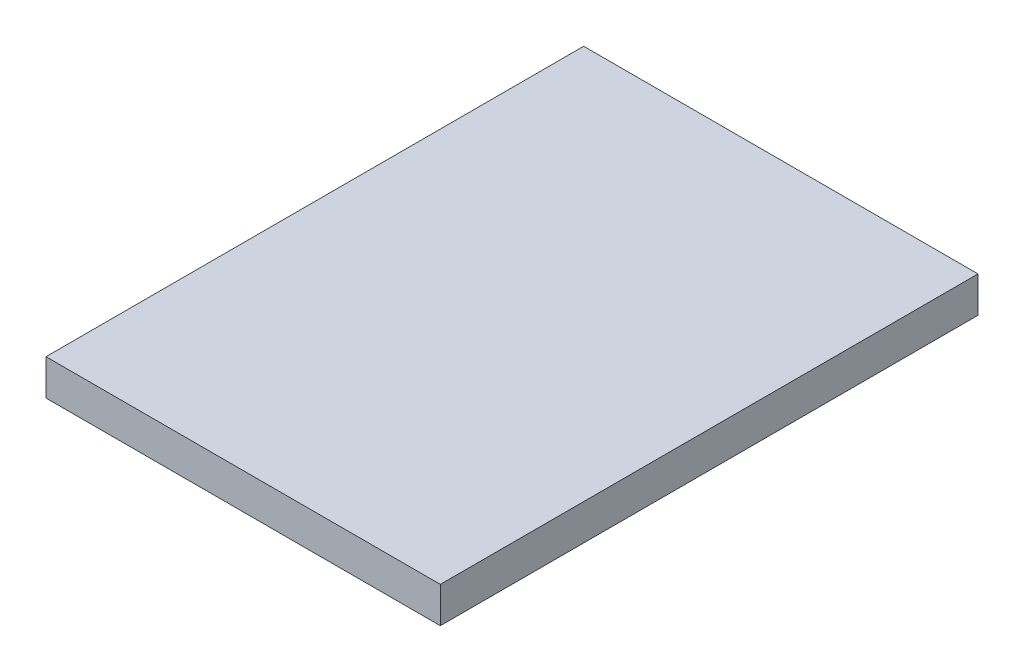
ISO-10303-21;
HEADER;
FILE_DESCRIPTION(('STEP AP214'),'2;1');
FILE_NAME('part.step','',(''),(''),'','','');
FILE_SCHEMA(('AUTOMOTIVE_DESIGN { 1 0 10303 214 1 1 1 1 }'));
ENDSEC;
DATA;
#1=APPLICATION_CONTEXT('core data for automotive mechanical design processes');
#2=APPLICATION_PROTOCOL_DEFINITION('international standard','automotive_design',2000,#1);
#3=PRODUCT_CONTEXT('',#1,'mechanical');
#4=PRODUCT('Part','Part','',(#3));
#5=PRODUCT_RELATED_PRODUCT_CATEGORY('part','',(#4));
#6=PRODUCT_DEFINITION_FORMATION('','',#4);
#7=PRODUCT_DEFINITION_CONTEXT('part definition',#1,'design');
#8=PRODUCT_DEFINITION('design','',#6,#7);
#9=PRODUCT_DEFINITION_SHAPE('','',#8);
#10=(LENGTH_UNIT() NAMED_UNIT(*) SI_UNIT(.MILLI.,.METRE.));
#11=(NAMED_UNIT(*) PLANE_ANGLE_UNIT() SI_UNIT($,.RADIAN.));
#12=(NAMED_UNIT(*) SI_UNIT($,.STERADIAN.) SOLID_ANGLE_UNIT());
#13=UNCERTAINTY_MEASURE_WITH_UNIT(LENGTH_MEASURE(1.E-05),#10,'distance_accuracy_value','');
#14=(GEOMETRIC_REPRESENTATION_CONTEXT(3) GLOBAL_UNCERTAINTY_ASSIGNED_CONTEXT((#13)) GLOBAL_UNIT_ASSIGNED_CONTEXT((#10,
#11,#12)) REPRESENTATION_CONTEXT('',''));
#15=CARTESIAN_POINT('',(0.,0.,0.));
#16=DIRECTION('',(0.,0.,1.));
#17=DIRECTION('',(1.,0.,0.));
#18=AXIS2_PLACEMENT_3D('',#15,#16,#17);
#19=CARTESIAN_POINT('',(-110.,20.,150.));
#20=DIRECTION('',(1.,0.,0.));
#21=DIRECTION('',(0.,0.,-1.));
#22=AXIS2_PLACEMENT_3D('',#19,#20,#21);
#23=PLANE('',#22);
#24=DIRECTION('',(0.,0.,1.));
#25=VECTOR('',#24,1.);
#26=CARTESIAN_POINT('',(-110.,0.,150.));
#27=LINE('',#26,#25);
#28=CARTESIAN_POINT('',(-110.,0.,-150.));
#29=VERTEX_POINT('',#28);
#30=CARTESIAN_POINT('',(-110.,0.,150.));
#31=VERTEX_POINT('',#30);
#32=EDGE_CURVE('E96',#29,#31,#27,.T.);
#33=ORIENTED_EDGE('',*,*,#32,.T.);
#34=DIRECTION('',(0.,-1.,0.));
#35=VECTOR('',#34,1.);
#36=CARTESIAN_POINT('',(-110.,20.,150.));
#37=LINE('',#36,#35);
#38=CARTESIAN_POINT('',(-110.,20.,150.));
#39=VERTEX_POINT('',#38);
#40=EDGE_CURVE('E11',#39,#31,#37,.T.);
#41=ORIENTED_EDGE('',*,*,#40,.F.);
#42=DIRECTION('',(0.,0.,1.));
#43=VECTOR('',#42,1.);
#44=CARTESIAN_POINT('',(-110.,20.,150.));
#45=LINE('',#44,#43);
#46=CARTESIAN_POINT('',(-110.,20.,-150.));
#47=VERTEX_POINT('',#46);
#48=EDGE_CURVE('E84',#47,#39,#45,.T.);
#49=ORIENTED_EDGE('',*,*,#48,.F.);
#50=DIRECTION('',(0.,-1.,0.));
#51=VECTOR('',#50,1.);
#52=CARTESIAN_POINT('',(-110.,20.,-150.));
#53=LINE('',#52,#51);
#54=EDGE_CURVE('E92',#47,#29,#53,.T.);
#55=ORIENTED_EDGE('',*,*,#54,.T.);
#56=EDGE_LOOP('',(#33,#41,#49,#55));
#57=FACE_BOUND('',#56,.T.);
#58=ADVANCED_FACE('F33',(#57),#23,.F.);
#59=CARTESIAN_POINT('',(110.,20.,150.));
#60=DIRECTION('',(0.,0.,-1.));
#61=DIRECTION('',(-1.,0.,0.));
#62=AXIS2_PLACEMENT_3D('',#59,#60,#61);
#63=PLANE('',#62);
#64=DIRECTION('',(1.,0.,0.));
#65=VECTOR('',#64,1.);
#66=CARTESIAN_POINT('',(110.,0.,150.));
#67=LINE('',#66,#65);
#68=CARTESIAN_POINT('',(110.,0.,150.));
#69=VERTEX_POINT('',#68);
#70=EDGE_CURVE('E88',#31,#69,#67,.T.);
#71=ORIENTED_EDGE('',*,*,#70,.T.);
#72=DIRECTION('',(0.,-1.,0.));
#73=VECTOR('',#72,1.);
#74=CARTESIAN_POINT('',(110.,20.,150.));
#75=LINE('',#74,#73);
#76=CARTESIAN_POINT('',(110.,20.,150.));
#77=VERTEX_POINT('',#76);
#78=EDGE_CURVE('E41',#77,#69,#75,.T.);
#79=ORIENTED_EDGE('',*,*,#78,.F.);
#80=DIRECTION('',(1.,0.,0.));
#81=VECTOR('',#80,1.);
#82=CARTESIAN_POINT('',(110.,20.,150.));
#83=LINE('',#82,#81);
#84=EDGE_CURVE('E79',#39,#77,#83,.T.);
#85=ORIENTED_EDGE('',*,*,#84,.F.);
#86=ORIENTED_EDGE('',*,*,#40,.T.);
#87=EDGE_LOOP('',(#71,#79,#85,#86));
#88=FACE_BOUND('',#87,.T.);
#89=ADVANCED_FACE('F87',(#88),#63,.F.);
#90=CARTESIAN_POINT('',(110.,20.,150.));
#91=DIRECTION('',(-1.,0.,0.));
#92=DIRECTION('',(0.,0.,1.));
#93=AXIS2_PLACEMENT_3D('',#90,#91,#92);
#94=PLANE('',#93);
#95=DIRECTION('',(0.,0.,-1.));
#96=VECTOR('',#95,1.);
#97=CARTESIAN_POINT('',(110.,0.,150.));
#98=LINE('',#97,#96);
#99=CARTESIAN_POINT('',(110.,0.,-150.));
#100=VERTEX_POINT('',#99);
#101=EDGE_CURVE('E66',#69,#100,#98,.T.);
#102=ORIENTED_EDGE('',*,*,#101,.T.);
#103=DIRECTION('',(0.,-1.,0.));
#104=VECTOR('',#103,1.);
#105=CARTESIAN_POINT('',(110.,20.,-150.));
#106=LINE('',#105,#104);
#107=CARTESIAN_POINT('',(110.,20.,-150.));
#108=VERTEX_POINT('',#107);
#109=EDGE_CURVE('E89',#108,#100,#106,.T.);
#110=ORIENTED_EDGE('',*,*,#109,.F.);
#111=DIRECTION('',(0.,0.,-1.));
#112=VECTOR('',#111,1.);
#113=CARTESIAN_POINT('',(110.,20.,150.));
#114=LINE('',#113,#112);
#115=EDGE_CURVE('E82',#77,#108,#114,.T.);
#116=ORIENTED_EDGE('',*,*,#115,.F.);
#117=ORIENTED_EDGE('',*,*,#78,.T.);
#118=EDGE_LOOP('',(#102,#110,#116,#117));
#119=FACE_BOUND('',#118,.T.);
#120=ADVANCED_FACE('F90',(#119),#94,.F.);
#121=CARTESIAN_POINT('',(110.,20.,-150.));
#122=DIRECTION('',(0.,0.,1.));
#123=DIRECTION('',(1.,0.,0.));
#124=AXIS2_PLACEMENT_3D('',#121,#122,#123);
#125=PLANE('',#124);
#126=DIRECTION('',(-1.,0.,0.));
#127=VECTOR('',#126,1.);
#128=CARTESIAN_POINT('',(110.,0.,-150.));
#129=LINE('',#128,#127);
#130=EDGE_CURVE('E72',#100,#29,#129,.T.);
#131=ORIENTED_EDGE('',*,*,#130,.T.);
#132=ORIENTED_EDGE('',*,*,#54,.F.);
#133=DIRECTION('',(-1.,0.,0.));
#134=VECTOR('',#133,1.);
#135=CARTESIAN_POINT('',(110.,20.,-150.));
#136=LINE('',#135,#134);
#137=EDGE_CURVE('E49',#108,#47,#136,.T.);
#138=ORIENTED_EDGE('',*,*,#137,.F.);
#139=ORIENTED_EDGE('',*,*,#109,.T.);
#140=EDGE_LOOP('',(#131,#132,#138,#139));
#141=FACE_BOUND('',#140,.T.);
#142=ADVANCED_FACE('F103',(#141),#125,.F.);
#143=CARTESIAN_POINT('',(0.,20.,0.));
#144=DIRECTION('',(0.,1.,0.));
#145=DIRECTION('',(0.,0.,1.));
#146=AXIS2_PLACEMENT_3D('',#143,#144,#145);
#147=PLANE('',#146);
#148=ORIENTED_EDGE('',*,*,#48,.T.);
#149=ORIENTED_EDGE('',*,*,#84,.T.);
#150=ORIENTED_EDGE('',*,*,#115,.T.);
#151=ORIENTED_EDGE('',*,*,#137,.T.);
#152=EDGE_LOOP('',(#148,#149,#150,#151));
#153=FACE_BOUND('',#152,.T.);
#154=ADVANCED_FACE('F80',(#153),#147,.T.);
#155=CARTESIAN_POINT('',(0.,0.,0.));
#156=DIRECTION('',(0.,1.,0.));
#157=DIRECTION('',(0.,0.,1.));
#158=AXIS2_PLACEMENT_3D('',#155,#156,#157);
#159=PLANE('',#158);
#160=ORIENTED_EDGE('',*,*,#32,.F.);
#161=ORIENTED_EDGE('',*,*,#130,.F.);
#162=ORIENTED_EDGE('',*,*,#101,.F.);
#163=ORIENTED_EDGE('',*,*,#70,.F.);
#164=EDGE_LOOP('',(#160,#161,#162,#163));
#165=FACE_BOUND('',#164,.T.);
#166=ADVANCED_FACE('F106',(#165),#159,.F.);
#167=CLOSED_SHELL('',(#58,#89,#120,#142,#154,#166));
#168=MANIFOLD_SOLID_BREP('B2',#167);
#169=ADVANCED_BREP_SHAPE_REPRESENTATION('',(#18,#168),#14);
#170=SHAPE_DEFINITION_REPRESENTATION(#9,#169);
ENDSEC;
END-ISO-10303-21;
